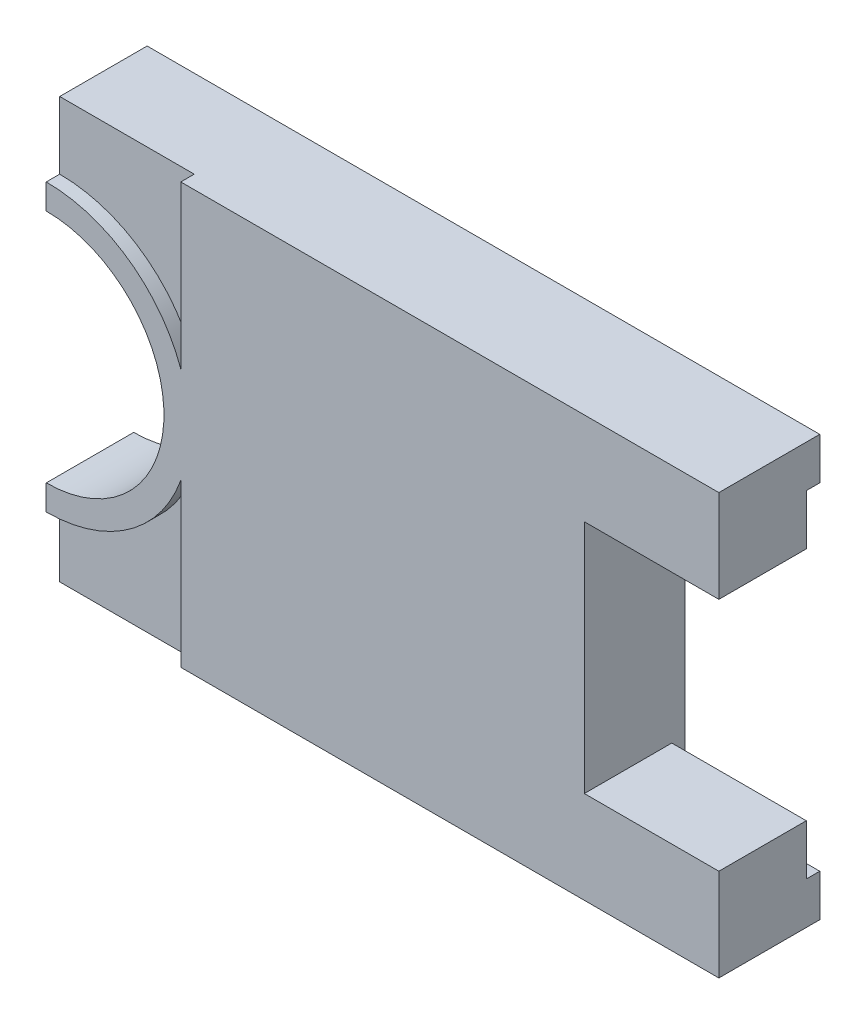
ISO-10303-21;
HEADER;
FILE_DESCRIPTION(('STEP AP214'),'2;1');
FILE_NAME('part.step','',(''),(''),'','','');
FILE_SCHEMA(('AUTOMOTIVE_DESIGN { 1 0 10303 214 1 1 1 1 }'));
ENDSEC;
DATA;
#1=APPLICATION_CONTEXT('core data for automotive mechanical design processes');
#2=APPLICATION_PROTOCOL_DEFINITION('international standard','automotive_design',2000,#1);
#3=PRODUCT_CONTEXT('',#1,'mechanical');
#4=PRODUCT('Part','Part','',(#3));
#5=PRODUCT_RELATED_PRODUCT_CATEGORY('part','',(#4));
#6=PRODUCT_DEFINITION_FORMATION('','',#4);
#7=PRODUCT_DEFINITION_CONTEXT('part definition',#1,'design');
#8=PRODUCT_DEFINITION('design','',#6,#7);
#9=PRODUCT_DEFINITION_SHAPE('','',#8);
#10=(LENGTH_UNIT() NAMED_UNIT(*) SI_UNIT(.MILLI.,.METRE.));
#11=(NAMED_UNIT(*) PLANE_ANGLE_UNIT() SI_UNIT($,.RADIAN.));
#12=(NAMED_UNIT(*) SI_UNIT($,.STERADIAN.) SOLID_ANGLE_UNIT());
#13=UNCERTAINTY_MEASURE_WITH_UNIT(LENGTH_MEASURE(1.E-05),#10,'distance_accuracy_value','');
#14=(GEOMETRIC_REPRESENTATION_CONTEXT(3) GLOBAL_UNCERTAINTY_ASSIGNED_CONTEXT((#13)) GLOBAL_UNIT_ASSIGNED_CONTEXT((#10,
#11,#12)) REPRESENTATION_CONTEXT('',''));
#15=CARTESIAN_POINT('',(0.,0.,0.));
#16=DIRECTION('',(0.,0.,1.));
#17=DIRECTION('',(1.,0.,0.));
#18=AXIS2_PLACEMENT_3D('',#15,#16,#17);
#19=CARTESIAN_POINT('',(-0.2,0.,0.04));
#20=DIRECTION('',(0.,0.,1.));
#21=DIRECTION('',(1.,0.,0.));
#22=AXIS2_PLACEMENT_3D('',#19,#20,#21);
#23=PLANE('',#22);
#24=DIRECTION('',(0.,-1.,0.));
#25=VECTOR('',#24,1.);
#26=CARTESIAN_POINT('',(0.2,-0.230940107676,0.04));
#27=LINE('',#26,#25);
#28=CARTESIAN_POINT('',(0.200000000000004,-0.230940107675994,0.04));
#29=VERTEX_POINT('',#28);
#30=CARTESIAN_POINT('',(0.2,0.230940107676,0.04));
#31=VERTEX_POINT('',#30);
#32=EDGE_CURVE('E161',#29,#31,#27,.F.);
#33=ORIENTED_EDGE('',*,*,#32,.F.);
#34=DIRECTION('',(-0.866025403784329,0.50000000000019,0.));
#35=VECTOR('',#34,1.);
#36=CARTESIAN_POINT('',(-0.2,0.,0.04));
#37=LINE('',#36,#35);
#38=CARTESIAN_POINT('',(-0.200000000000004,0.,0.04));
#39=VERTEX_POINT('',#38);
#40=EDGE_CURVE('E463',#39,#29,#37,.F.);
#41=ORIENTED_EDGE('',*,*,#40,.F.);
#42=DIRECTION('',(0.866025403784329,0.50000000000019,0.));
#43=VECTOR('',#42,1.);
#44=CARTESIAN_POINT('',(0.2,0.230940107676,0.04));
#45=LINE('',#44,#43);
#46=EDGE_CURVE('E454',#31,#39,#45,.F.);
#47=ORIENTED_EDGE('',*,*,#46,.F.);
#48=EDGE_LOOP('',(#33,#41,#47));
#49=FACE_BOUND('',#48,.T.);
#50=ADVANCED_FACE('F17',(#49),#23,.F.);
#51=CARTESIAN_POINT('',(-1.,-0.625,0.3));
#52=DIRECTION('',(0.,1.,0.));
#53=DIRECTION('',(-1.,0.,0.));
#54=AXIS2_PLACEMENT_3D('',#51,#52,#53);
#55=PLANE('',#54);
#56=DIRECTION('',(-1.,0.,0.));
#57=VECTOR('',#56,1.);
#58=CARTESIAN_POINT('',(-1.,-0.625,0.26));
#59=LINE('',#58,#57);
#60=CARTESIAN_POINT('',(-1.,-0.625,0.26));
#61=VERTEX_POINT('',#60);
#62=CARTESIAN_POINT('',(-0.6,-0.625,0.26));
#63=VERTEX_POINT('',#62);
#64=EDGE_CURVE('E162',#61,#63,#59,.F.);
#65=ORIENTED_EDGE('',*,*,#64,.F.);
#66=DIRECTION('',(0.,0.,1.));
#67=VECTOR('',#66,1.);
#68=CARTESIAN_POINT('',(-1.,-0.625,0.3));
#69=LINE('',#68,#67);
#70=CARTESIAN_POINT('',(-1.,-0.625,0.));
#71=VERTEX_POINT('',#70);
#72=EDGE_CURVE('E178',#71,#61,#69,.T.);
#73=ORIENTED_EDGE('',*,*,#72,.F.);
#74=DIRECTION('',(1.,0.,0.));
#75=VECTOR('',#74,1.);
#76=CARTESIAN_POINT('',(-1.,-0.625,0.));
#77=LINE('',#76,#75);
#78=CARTESIAN_POINT('',(1.,-0.625,0.));
#79=VERTEX_POINT('',#78);
#80=EDGE_CURVE('E414',#71,#79,#77,.T.);
#81=ORIENTED_EDGE('',*,*,#80,.T.);
#82=DIRECTION('',(0.,0.,1.));
#83=VECTOR('',#82,1.);
#84=CARTESIAN_POINT('',(1.,-0.625,0.3));
#85=LINE('',#84,#83);
#86=CARTESIAN_POINT('',(1.,-0.625,0.3));
#87=VERTEX_POINT('',#86);
#88=EDGE_CURVE('E176',#87,#79,#85,.F.);
#89=ORIENTED_EDGE('',*,*,#88,.F.);
#90=DIRECTION('',(-1.,0.,0.));
#91=VECTOR('',#90,1.);
#92=CARTESIAN_POINT('',(-1.,-0.625,0.3));
#93=LINE('',#92,#91);
#94=CARTESIAN_POINT('',(-0.6,-0.625,0.3));
#95=VERTEX_POINT('',#94);
#96=EDGE_CURVE('E168',#95,#87,#93,.F.);
#97=ORIENTED_EDGE('',*,*,#96,.F.);
#98=DIRECTION('',(0.,0.,1.));
#99=VECTOR('',#98,1.);
#100=CARTESIAN_POINT('',(-0.6,-0.625,0.3));
#101=LINE('',#100,#99);
#102=EDGE_CURVE('E151',#63,#95,#101,.T.);
#103=ORIENTED_EDGE('',*,*,#102,.F.);
#104=EDGE_LOOP('',(#65,#73,#81,#89,#97,#103));
#105=FACE_BOUND('',#104,.T.);
#106=ADVANCED_FACE('F174',(#105),#55,.F.);
#107=CARTESIAN_POINT('',(0.2,-0.230940107676,0.04));
#108=DIRECTION('',(-1.,0.,0.));
#109=DIRECTION('',(0.,-1.,0.));
#110=AXIS2_PLACEMENT_3D('',#107,#108,#109);
#111=PLANE('',#110);
#112=ORIENTED_EDGE('',*,*,#32,.T.);
#113=DIRECTION('',(0.,0.,1.));
#114=VECTOR('',#113,1.);
#115=CARTESIAN_POINT('',(0.2,0.230940107676,0.04));
#116=LINE('',#115,#114);
#117=CARTESIAN_POINT('',(0.2,0.230940107676,0.));
#118=VERTEX_POINT('',#117);
#119=EDGE_CURVE('E457',#118,#31,#116,.T.);
#120=ORIENTED_EDGE('',*,*,#119,.F.);
#121=DIRECTION('',(0.,1.,0.));
#122=VECTOR('',#121,1.);
#123=CARTESIAN_POINT('',(0.2,-0.625,0.));
#124=LINE('',#123,#122);
#125=CARTESIAN_POINT('',(0.200000000000004,-0.230940107675994,0.));
#126=VERTEX_POINT('',#125);
#127=EDGE_CURVE('E353',#118,#126,#124,.F.);
#128=ORIENTED_EDGE('',*,*,#127,.T.);
#129=DIRECTION('',(0.,0.,1.));
#130=VECTOR('',#129,1.);
#131=CARTESIAN_POINT('',(0.200000000000014,-0.230940107675975,0.04));
#132=LINE('',#131,#130);
#133=EDGE_CURVE('E460',#29,#126,#132,.F.);
#134=ORIENTED_EDGE('',*,*,#133,.F.);
#135=EDGE_LOOP('',(#112,#120,#128,#134));
#136=FACE_BOUND('',#135,.T.);
#137=ADVANCED_FACE('F513',(#136),#111,.T.);
#138=CARTESIAN_POINT('',(-0.2,0.,0.04));
#139=DIRECTION('',(0.50000000000019,0.866025403784329,0.));
#140=DIRECTION('',(-0.866025403784329,0.50000000000019,0.));
#141=AXIS2_PLACEMENT_3D('',#138,#139,#140);
#142=PLANE('',#141);
#143=ORIENTED_EDGE('',*,*,#40,.T.);
#144=ORIENTED_EDGE('',*,*,#133,.T.);
#145=DIRECTION('',(-0.866025403784298,0.500000000000243,0.));
#146=VECTOR('',#145,1.);
#147=CARTESIAN_POINT('',(0.2,-0.230940107676,0.));
#148=LINE('',#147,#146);
#149=CARTESIAN_POINT('',(-0.200000000000004,0.,0.));
#150=VERTEX_POINT('',#149);
#151=EDGE_CURVE('E350',#126,#150,#148,.T.);
#152=ORIENTED_EDGE('',*,*,#151,.T.);
#153=DIRECTION('',(0.,0.,1.));
#154=VECTOR('',#153,1.);
#155=CARTESIAN_POINT('',(-0.200000000000014,0.,0.04));
#156=LINE('',#155,#154);
#157=EDGE_CURVE('E402',#39,#150,#156,.F.);
#158=ORIENTED_EDGE('',*,*,#157,.F.);
#159=EDGE_LOOP('',(#143,#144,#152,#158));
#160=FACE_BOUND('',#159,.T.);
#161=ADVANCED_FACE('F518',(#160),#142,.T.);
#162=CARTESIAN_POINT('',(0.2,0.230940107676,0.04));
#163=DIRECTION('',(0.50000000000019,-0.866025403784329,0.));
#164=DIRECTION('',(0.866025403784329,0.50000000000019,0.));
#165=AXIS2_PLACEMENT_3D('',#162,#163,#164);
#166=PLANE('',#165);
#167=ORIENTED_EDGE('',*,*,#46,.T.);
#168=ORIENTED_EDGE('',*,*,#157,.T.);
#169=DIRECTION('',(0.866025403784298,0.500000000000243,0.));
#170=VECTOR('',#169,1.);
#171=CARTESIAN_POINT('',(-0.2,0.,0.));
#172=LINE('',#171,#170);
#173=EDGE_CURVE('E346',#150,#118,#172,.T.);
#174=ORIENTED_EDGE('',*,*,#173,.T.);
#175=ORIENTED_EDGE('',*,*,#119,.T.);
#176=EDGE_LOOP('',(#167,#168,#174,#175));
#177=FACE_BOUND('',#176,.T.);
#178=ADVANCED_FACE('F521',(#177),#166,.T.);
#179=CARTESIAN_POINT('',(-0.6,-0.35,2.377498685594));
#180=DIRECTION('',(-1.,0.,0.));
#181=DIRECTION('',(0.,0.,1.));
#182=AXIS2_PLACEMENT_3D('',#179,#180,#181);
#183=PLANE('',#182);
#184=DIRECTION('',(0.,1.,0.));
#185=VECTOR('',#184,1.);
#186=CARTESIAN_POINT('',(-0.6,-0.625,0.));
#187=LINE('',#186,#185);
#188=CARTESIAN_POINT('',(-0.6,0.5,0.));
#189=VERTEX_POINT('',#188);
#190=CARTESIAN_POINT('',(-0.6,-0.5,0.));
#191=VERTEX_POINT('',#190);
#192=EDGE_CURVE('E359',#189,#191,#187,.F.);
#193=ORIENTED_EDGE('',*,*,#192,.T.);
#194=DIRECTION('',(0.,0.,1.));
#195=VECTOR('',#194,1.);
#196=CARTESIAN_POINT('',(-0.6,-0.5,0.04));
#197=LINE('',#196,#195);
#198=CARTESIAN_POINT('',(-0.6,-0.5,0.04));
#199=VERTEX_POINT('',#198);
#200=EDGE_CURVE('E297',#199,#191,#197,.F.);
#201=ORIENTED_EDGE('',*,*,#200,.F.);
#202=DIRECTION('',(0.,1.,0.));
#203=VECTOR('',#202,1.);
#204=CARTESIAN_POINT('',(-0.6,-0.5,0.04));
#205=LINE('',#204,#203);
#206=CARTESIAN_POINT('',(-0.6,0.5,0.04));
#207=VERTEX_POINT('',#206);
#208=EDGE_CURVE('E296',#199,#207,#205,.T.);
#209=ORIENTED_EDGE('',*,*,#208,.T.);
#210=DIRECTION('',(0.,0.,-1.));
#211=VECTOR('',#210,1.);
#212=CARTESIAN_POINT('',(-0.6,0.5,0.04));
#213=LINE('',#212,#211);
#214=EDGE_CURVE('E305',#189,#207,#213,.F.);
#215=ORIENTED_EDGE('',*,*,#214,.F.);
#216=EDGE_LOOP('',(#193,#201,#209,#215));
#217=FACE_BOUND('',#216,.T.);
#218=ADVANCED_FACE('F847',(#217),#183,.T.);
#219=CARTESIAN_POINT('',(1.,-0.5,0.04));
#220=DIRECTION('',(0.,-1.,0.));
#221=DIRECTION('',(0.,0.,-1.));
#222=AXIS2_PLACEMENT_3D('',#219,#220,#221);
#223=PLANE('',#222);
#224=DIRECTION('',(0.,0.,1.));
#225=VECTOR('',#224,1.);
#226=CARTESIAN_POINT('',(0.6,-0.5,2.377498685594));
#227=LINE('',#226,#225);
#228=CARTESIAN_POINT('',(0.6,-0.5,0.));
#229=VERTEX_POINT('',#228);
#230=CARTESIAN_POINT('',(0.6,-0.5,0.0400000000000001));
#231=VERTEX_POINT('',#230);
#232=EDGE_CURVE('E393',#229,#231,#227,.T.);
#233=ORIENTED_EDGE('',*,*,#232,.T.);
#234=DIRECTION('',(-1.,0.,0.));
#235=VECTOR('',#234,1.);
#236=CARTESIAN_POINT('',(1.,-0.5,0.04));
#237=LINE('',#236,#235);
#238=CARTESIAN_POINT('',(1.,-0.5,0.04));
#239=VERTEX_POINT('',#238);
#240=EDGE_CURVE('E385',#239,#231,#237,.T.);
#241=ORIENTED_EDGE('',*,*,#240,.F.);
#242=DIRECTION('',(0.,0.,1.));
#243=VECTOR('',#242,1.);
#244=CARTESIAN_POINT('',(1.,-0.5,0.3));
#245=LINE('',#244,#243);
#246=CARTESIAN_POINT('',(1.,-0.5,0.));
#247=VERTEX_POINT('',#246);
#248=EDGE_CURVE('E420',#239,#247,#245,.F.);
#249=ORIENTED_EDGE('',*,*,#248,.T.);
#250=DIRECTION('',(1.,0.,0.));
#251=VECTOR('',#250,1.);
#252=CARTESIAN_POINT('',(-1.,-0.5,0.));
#253=LINE('',#252,#251);
#254=EDGE_CURVE('E356',#247,#229,#253,.F.);
#255=ORIENTED_EDGE('',*,*,#254,.T.);
#256=EDGE_LOOP('',(#233,#241,#249,#255));
#257=FACE_BOUND('',#256,.T.);
#258=ADVANCED_FACE('F838',(#257),#223,.F.);
#259=CARTESIAN_POINT('',(1.,-0.5,0.04));
#260=DIRECTION('',(0.,0.,-1.));
#261=DIRECTION('',(-1.,0.,0.));
#262=AXIS2_PLACEMENT_3D('',#259,#260,#261);
#263=PLANE('',#262);
#264=ORIENTED_EDGE('',*,*,#240,.T.);
#265=DIRECTION('',(0.,1.,0.));
#266=VECTOR('',#265,1.);
#267=CARTESIAN_POINT('',(0.6,-0.35,0.0400000000000001));
#268=LINE('',#267,#266);
#269=CARTESIAN_POINT('',(0.6,-0.35,0.0400000000000001));
#270=VERTEX_POINT('',#269);
#271=EDGE_CURVE('E265',#231,#270,#268,.T.);
#272=ORIENTED_EDGE('',*,*,#271,.T.);
#273=DIRECTION('',(1.,0.,0.));
#274=VECTOR('',#273,1.);
#275=CARTESIAN_POINT('',(1.,-0.35,0.0400000000000001));
#276=LINE('',#275,#274);
#277=CARTESIAN_POINT('',(1.,-0.35,0.0400000000000001));
#278=VERTEX_POINT('',#277);
#279=EDGE_CURVE('E275',#270,#278,#276,.T.);
#280=ORIENTED_EDGE('',*,*,#279,.T.);
#281=DIRECTION('',(0.,1.,0.));
#282=VECTOR('',#281,1.);
#283=CARTESIAN_POINT('',(1.,-0.625,0.04));
#284=LINE('',#283,#282);
#285=EDGE_CURVE('E417',#278,#239,#284,.F.);
#286=ORIENTED_EDGE('',*,*,#285,.T.);
#287=EDGE_LOOP('',(#264,#272,#280,#286));
#288=FACE_BOUND('',#287,.T.);
#289=ADVANCED_FACE('F541',(#288),#263,.T.);
#290=CARTESIAN_POINT('',(0.6,0.5,0.04));
#291=DIRECTION('',(0.,1.,0.));
#292=DIRECTION('',(0.,0.,1.));
#293=AXIS2_PLACEMENT_3D('',#290,#291,#292);
#294=PLANE('',#293);
#295=DIRECTION('',(0.,0.,1.));
#296=VECTOR('',#295,1.);
#297=CARTESIAN_POINT('',(1.,0.5,0.3));
#298=LINE('',#297,#296);
#299=CARTESIAN_POINT('',(1.,0.5,0.));
#300=VERTEX_POINT('',#299);
#301=CARTESIAN_POINT('',(1.,0.5,0.04));
#302=VERTEX_POINT('',#301);
#303=EDGE_CURVE('E343',#300,#302,#298,.T.);
#304=ORIENTED_EDGE('',*,*,#303,.T.);
#305=DIRECTION('',(-1.,0.,0.));
#306=VECTOR('',#305,1.);
#307=CARTESIAN_POINT('',(1.,0.5,0.04));
#308=LINE('',#307,#306);
#309=CARTESIAN_POINT('',(0.6,0.5,0.0400000000000001));
#310=VERTEX_POINT('',#309);
#311=EDGE_CURVE('E364',#310,#302,#308,.F.);
#312=ORIENTED_EDGE('',*,*,#311,.F.);
#313=DIRECTION('',(0.,0.,1.));
#314=VECTOR('',#313,1.);
#315=CARTESIAN_POINT('',(0.6,0.5,2.377498685594));
#316=LINE('',#315,#314);
#317=CARTESIAN_POINT('',(0.6,0.5,0.));
#318=VERTEX_POINT('',#317);
#319=EDGE_CURVE('E380',#310,#318,#316,.F.);
#320=ORIENTED_EDGE('',*,*,#319,.T.);
#321=DIRECTION('',(1.,0.,0.));
#322=VECTOR('',#321,1.);
#323=CARTESIAN_POINT('',(-1.,0.5,0.));
#324=LINE('',#323,#322);
#325=EDGE_CURVE('E360',#318,#300,#324,.T.);
#326=ORIENTED_EDGE('',*,*,#325,.T.);
#327=EDGE_LOOP('',(#304,#312,#320,#326));
#328=FACE_BOUND('',#327,.T.);
#329=ADVANCED_FACE('F819',(#328),#294,.F.);
#330=CARTESIAN_POINT('',(1.,-0.5,0.04));
#331=DIRECTION('',(0.,0.,-1.));
#332=DIRECTION('',(-1.,0.,0.));
#333=AXIS2_PLACEMENT_3D('',#330,#331,#332);
#334=PLANE('',#333);
#335=ORIENTED_EDGE('',*,*,#311,.T.);
#336=DIRECTION('',(0.,1.,0.));
#337=VECTOR('',#336,1.);
#338=CARTESIAN_POINT('',(1.,-0.625,0.04));
#339=LINE('',#338,#337);
#340=CARTESIAN_POINT('',(1.,0.35,0.04));
#341=VERTEX_POINT('',#340);
#342=EDGE_CURVE('E325',#302,#341,#339,.F.);
#343=ORIENTED_EDGE('',*,*,#342,.T.);
#344=DIRECTION('',(-1.,0.,0.));
#345=VECTOR('',#344,1.);
#346=CARTESIAN_POINT('',(0.6,0.35,0.0400000000000001));
#347=LINE('',#346,#345);
#348=CARTESIAN_POINT('',(0.6,0.35,0.0400000000000001));
#349=VERTEX_POINT('',#348);
#350=EDGE_CURVE('E242',#341,#349,#347,.T.);
#351=ORIENTED_EDGE('',*,*,#350,.T.);
#352=DIRECTION('',(0.,1.,0.));
#353=VECTOR('',#352,1.);
#354=CARTESIAN_POINT('',(0.6,-0.35,0.0400000000000001));
#355=LINE('',#354,#353);
#356=EDGE_CURVE('E264',#349,#310,#355,.T.);
#357=ORIENTED_EDGE('',*,*,#356,.T.);
#358=EDGE_LOOP('',(#335,#343,#351,#357));
#359=FACE_BOUND('',#358,.T.);
#360=ADVANCED_FACE('F809',(#359),#334,.T.);
#361=CARTESIAN_POINT('',(-1.,-0.625,0.));
#362=DIRECTION('',(0.,0.,1.));
#363=DIRECTION('',(1.,0.,0.));
#364=AXIS2_PLACEMENT_3D('',#361,#362,#363);
#365=PLANE('',#364);
#366=ORIENTED_EDGE('',*,*,#151,.F.);
#367=ORIENTED_EDGE('',*,*,#127,.F.);
#368=ORIENTED_EDGE('',*,*,#173,.F.);
#369=EDGE_LOOP('',(#366,#367,#368));
#370=FACE_BOUND('',#369,.T.);
#371=ORIENTED_EDGE('',*,*,#254,.F.);
#372=DIRECTION('',(0.,1.,0.));
#373=VECTOR('',#372,1.);
#374=CARTESIAN_POINT('',(1.,-0.625,0.));
#375=LINE('',#374,#373);
#376=EDGE_CURVE('E276',#247,#79,#375,.F.);
#377=ORIENTED_EDGE('',*,*,#376,.T.);
#378=ORIENTED_EDGE('',*,*,#80,.F.);
#379=DIRECTION('',(0.,1.,0.));
#380=VECTOR('',#379,1.);
#381=CARTESIAN_POINT('',(-1.,-0.625,0.));
#382=LINE('',#381,#380);
#383=CARTESIAN_POINT('',(-1.,-0.5,0.));
#384=VERTEX_POINT('',#383);
#385=EDGE_CURVE('E84',#384,#71,#382,.F.);
#386=ORIENTED_EDGE('',*,*,#385,.F.);
#387=DIRECTION('',(-1.,0.,0.));
#388=VECTOR('',#387,1.);
#389=CARTESIAN_POINT('',(-1.,-0.5,0.));
#390=LINE('',#389,#388);
#391=EDGE_CURVE('E303',#191,#384,#390,.T.);
#392=ORIENTED_EDGE('',*,*,#391,.F.);
#393=ORIENTED_EDGE('',*,*,#192,.F.);
#394=DIRECTION('',(1.,0.,0.));
#395=VECTOR('',#394,1.);
#396=CARTESIAN_POINT('',(-0.6,0.5,0.));
#397=LINE('',#396,#395);
#398=CARTESIAN_POINT('',(-1.,0.5,0.));
#399=VERTEX_POINT('',#398);
#400=EDGE_CURVE('E349',#399,#189,#397,.T.);
#401=ORIENTED_EDGE('',*,*,#400,.F.);
#402=DIRECTION('',(0.,1.,0.));
#403=VECTOR('',#402,1.);
#404=CARTESIAN_POINT('',(-1.,-0.625,0.));
#405=LINE('',#404,#403);
#406=CARTESIAN_POINT('',(-1.,0.625,0.));
#407=VERTEX_POINT('',#406);
#408=EDGE_CURVE('E357',#407,#399,#405,.F.);
#409=ORIENTED_EDGE('',*,*,#408,.F.);
#410=DIRECTION('',(1.,0.,0.));
#411=VECTOR('',#410,1.);
#412=CARTESIAN_POINT('',(1.,0.625,0.));
#413=LINE('',#412,#411);
#414=CARTESIAN_POINT('',(1.,0.625,0.));
#415=VERTEX_POINT('',#414);
#416=EDGE_CURVE('E230',#407,#415,#413,.T.);
#417=ORIENTED_EDGE('',*,*,#416,.T.);
#418=DIRECTION('',(0.,1.,0.));
#419=VECTOR('',#418,1.);
#420=CARTESIAN_POINT('',(1.,-0.625,0.));
#421=LINE('',#420,#419);
#422=EDGE_CURVE('E241',#415,#300,#421,.F.);
#423=ORIENTED_EDGE('',*,*,#422,.T.);
#424=ORIENTED_EDGE('',*,*,#325,.F.);
#425=DIRECTION('',(0.,1.,0.));
#426=VECTOR('',#425,1.);
#427=CARTESIAN_POINT('',(0.6,-0.35,0.));
#428=LINE('',#427,#426);
#429=EDGE_CURVE('E253',#318,#229,#428,.F.);
#430=ORIENTED_EDGE('',*,*,#429,.T.);
#431=EDGE_LOOP('',(#371,#377,#378,#386,#392,#393,#401,#409,#417,#423,#424,#430));
#432=FACE_BOUND('',#431,.T.);
#433=ADVANCED_FACE('F485',(#370,#432),#365,.F.);
#434=CARTESIAN_POINT('',(-0.6,0.5,0.04));
#435=DIRECTION('',(0.,-1.,0.));
#436=DIRECTION('',(0.,0.,-1.));
#437=AXIS2_PLACEMENT_3D('',#434,#435,#436);
#438=PLANE('',#437);
#439=DIRECTION('',(1.,0.,0.));
#440=VECTOR('',#439,1.);
#441=CARTESIAN_POINT('',(-1.,0.5,0.04));
#442=LINE('',#441,#440);
#443=CARTESIAN_POINT('',(-1.,0.5,0.04));
#444=VERTEX_POINT('',#443);
#445=EDGE_CURVE('E328',#207,#444,#442,.F.);
#446=ORIENTED_EDGE('',*,*,#445,.T.);
#447=DIRECTION('',(0.,0.,-1.));
#448=VECTOR('',#447,1.);
#449=CARTESIAN_POINT('',(-1.,0.5,0.3));
#450=LINE('',#449,#448);
#451=EDGE_CURVE('E207',#444,#399,#450,.T.);
#452=ORIENTED_EDGE('',*,*,#451,.T.);
#453=ORIENTED_EDGE('',*,*,#400,.T.);
#454=ORIENTED_EDGE('',*,*,#214,.T.);
#455=EDGE_LOOP('',(#446,#452,#453,#454));
#456=FACE_BOUND('',#455,.T.);
#457=ADVANCED_FACE('F601',(#456),#438,.T.);
#458=CARTESIAN_POINT('',(-1.,0.,0.26));
#459=DIRECTION('',(0.,0.,-1.));
#460=DIRECTION('',(-1.,0.,0.));
#461=AXIS2_PLACEMENT_3D('',#458,#459,#460);
#462=PLANE('',#461);
#463=DIRECTION('',(1.,0.,0.));
#464=VECTOR('',#463,1.);
#465=CARTESIAN_POINT('',(1.,0.625,0.26));
#466=LINE('',#465,#464);
#467=CARTESIAN_POINT('',(-0.6,0.625,0.26));
#468=VERTEX_POINT('',#467);
#469=CARTESIAN_POINT('',(-1.,0.625,0.26));
#470=VERTEX_POINT('',#469);
#471=EDGE_CURVE('E229',#468,#470,#466,.F.);
#472=ORIENTED_EDGE('',*,*,#471,.T.);
#473=DIRECTION('',(0.,1.,0.));
#474=VECTOR('',#473,1.);
#475=CARTESIAN_POINT('',(-1.,0.625,0.26));
#476=LINE('',#475,#474);
#477=CARTESIAN_POINT('',(-1.,0.425,0.26));
#478=VERTEX_POINT('',#477);
#479=EDGE_CURVE('E310',#470,#478,#476,.F.);
#480=ORIENTED_EDGE('',*,*,#479,.T.);
#481=CARTESIAN_POINT('',(-1.,0.,0.26));
#482=DIRECTION('',(0.,0.,-1.));
#483=DIRECTION('',(-1.,0.,0.));
#484=AXIS2_PLACEMENT_3D('',#481,#482,#483);
#485=CIRCLE('',#484,0.425);
#486=CARTESIAN_POINT('',(-0.599999999999928,0.143614066163251,0.26));
#487=VERTEX_POINT('',#486);
#488=EDGE_CURVE('E198',#487,#478,#485,.F.);
#489=ORIENTED_EDGE('',*,*,#488,.F.);
#490=DIRECTION('',(0.,1.,0.));
#491=VECTOR('',#490,1.);
#492=CARTESIAN_POINT('',(-0.6,0.143614066163,0.26));
#493=LINE('',#492,#491);
#494=EDGE_CURVE('E213',#487,#468,#493,.T.);
#495=ORIENTED_EDGE('',*,*,#494,.T.);
#496=EDGE_LOOP('',(#472,#480,#489,#495));
#497=FACE_BOUND('',#496,.T.);
#498=ADVANCED_FACE('F576',(#497),#462,.F.);
#499=CARTESIAN_POINT('',(-1.,0.,0.26));
#500=DIRECTION('',(0.,0.,1.));
#501=DIRECTION('',(1.,0.,0.));
#502=AXIS2_PLACEMENT_3D('',#499,#500,#501);
#503=PLANE('',#502);
#504=DIRECTION('',(0.,1.,0.));
#505=VECTOR('',#504,1.);
#506=CARTESIAN_POINT('',(-1.,0.625,0.26));
#507=LINE('',#506,#505);
#508=CARTESIAN_POINT('',(-1.,-0.425,0.26));
#509=VERTEX_POINT('',#508);
#510=EDGE_CURVE('E284',#509,#61,#507,.F.);
#511=ORIENTED_EDGE('',*,*,#510,.T.);
#512=ORIENTED_EDGE('',*,*,#64,.T.);
#513=DIRECTION('',(0.,-1.,0.));
#514=VECTOR('',#513,1.);
#515=CARTESIAN_POINT('',(-0.6,-0.143614066163,0.26));
#516=LINE('',#515,#514);
#517=CARTESIAN_POINT('',(-0.6,-0.143614066163225,0.26));
#518=VERTEX_POINT('',#517);
#519=EDGE_CURVE('E157',#518,#63,#516,.T.);
#520=ORIENTED_EDGE('',*,*,#519,.F.);
#521=CARTESIAN_POINT('',(-1.,0.,0.26));
#522=DIRECTION('',(0.,0.,-1.));
#523=DIRECTION('',(-1.,0.,0.));
#524=AXIS2_PLACEMENT_3D('',#521,#522,#523);
#525=CIRCLE('',#524,0.425);
#526=EDGE_CURVE('E20',#509,#518,#525,.F.);
#527=ORIENTED_EDGE('',*,*,#526,.F.);
#528=EDGE_LOOP('',(#511,#512,#520,#527));
#529=FACE_BOUND('',#528,.T.);
#530=ADVANCED_FACE('F480',(#529),#503,.T.);
#531=CARTESIAN_POINT('',(-1.,-0.5,0.04));
#532=DIRECTION('',(0.,1.,0.));
#533=DIRECTION('',(-1.,0.,0.));
#534=AXIS2_PLACEMENT_3D('',#531,#532,#533);
#535=PLANE('',#534);
#536=DIRECTION('',(1.,0.,0.));
#537=VECTOR('',#536,1.);
#538=CARTESIAN_POINT('',(-1.,-0.5,0.04));
#539=LINE('',#538,#537);
#540=CARTESIAN_POINT('',(-1.,-0.5,0.04));
#541=VERTEX_POINT('',#540);
#542=EDGE_CURVE('E293',#541,#199,#539,.T.);
#543=ORIENTED_EDGE('',*,*,#542,.T.);
#544=ORIENTED_EDGE('',*,*,#200,.T.);
#545=ORIENTED_EDGE('',*,*,#391,.T.);
#546=DIRECTION('',(0.,0.,-1.));
#547=VECTOR('',#546,1.);
#548=CARTESIAN_POINT('',(-1.,-0.5,0.3));
#549=LINE('',#548,#547);
#550=EDGE_CURVE('E286',#384,#541,#549,.F.);
#551=ORIENTED_EDGE('',*,*,#550,.T.);
#552=EDGE_LOOP('',(#543,#544,#545,#551));
#553=FACE_BOUND('',#552,.T.);
#554=ADVANCED_FACE('F621',(#553),#535,.T.);
#555=CARTESIAN_POINT('',(-1.,-0.5,0.04));
#556=DIRECTION('',(0.,0.,1.));
#557=DIRECTION('',(1.,0.,0.));
#558=AXIS2_PLACEMENT_3D('',#555,#556,#557);
#559=PLANE('',#558);
#560=CARTESIAN_POINT('',(-1.,0.,0.04));
#561=DIRECTION('',(0.,0.,-1.));
#562=DIRECTION('',(-1.,0.,0.));
#563=AXIS2_PLACEMENT_3D('',#560,#561,#562);
#564=CIRCLE('',#563,0.35);
#565=CARTESIAN_POINT('',(-1.,-0.35,0.04));
#566=VERTEX_POINT('',#565);
#567=CARTESIAN_POINT('',(-1.,0.35,0.04));
#568=VERTEX_POINT('',#567);
#569=EDGE_CURVE('E195',#566,#568,#564,.F.);
#570=ORIENTED_EDGE('',*,*,#569,.T.);
#571=DIRECTION('',(0.,1.,0.));
#572=VECTOR('',#571,1.);
#573=CARTESIAN_POINT('',(-1.,0.625,0.04));
#574=LINE('',#573,#572);
#575=EDGE_CURVE('E200',#568,#444,#574,.T.);
#576=ORIENTED_EDGE('',*,*,#575,.T.);
#577=ORIENTED_EDGE('',*,*,#445,.F.);
#578=ORIENTED_EDGE('',*,*,#208,.F.);
#579=ORIENTED_EDGE('',*,*,#542,.F.);
#580=DIRECTION('',(0.,1.,0.));
#581=VECTOR('',#580,1.);
#582=CARTESIAN_POINT('',(-1.,0.625,0.04));
#583=LINE('',#582,#581);
#584=EDGE_CURVE('E289',#541,#566,#583,.T.);
#585=ORIENTED_EDGE('',*,*,#584,.T.);
#586=EDGE_LOOP('',(#570,#576,#577,#578,#579,#585));
#587=FACE_BOUND('',#586,.T.);
#588=ADVANCED_FACE('F605',(#587),#559,.F.);
#589=CARTESIAN_POINT('',(-1.,0.,0.26));
#590=DIRECTION('',(0.,0.,-1.));
#591=DIRECTION('',(-1.,0.,0.));
#592=AXIS2_PLACEMENT_3D('',#589,#590,#591);
#593=CYLINDRICAL_SURFACE('',#592,0.425);
#594=ORIENTED_EDGE('',*,*,#526,.T.);
#595=DIRECTION('',(0.,0.,1.));
#596=VECTOR('',#595,1.);
#597=CARTESIAN_POINT('',(-0.6,-0.143614066163,0.26));
#598=LINE('',#597,#596);
#599=CARTESIAN_POINT('',(-0.6,-0.143614066163225,0.3));
#600=VERTEX_POINT('',#599);
#601=EDGE_CURVE('E282',#600,#518,#598,.F.);
#602=ORIENTED_EDGE('',*,*,#601,.F.);
#603=CARTESIAN_POINT('',(-1.,0.,0.3));
#604=DIRECTION('',(0.,0.,-1.));
#605=DIRECTION('',(-1.,0.,0.));
#606=AXIS2_PLACEMENT_3D('',#603,#604,#605);
#607=CIRCLE('',#606,0.425);
#608=CARTESIAN_POINT('',(-1.,-0.425,0.3));
#609=VERTEX_POINT('',#608);
#610=EDGE_CURVE('E170',#609,#600,#607,.F.);
#611=ORIENTED_EDGE('',*,*,#610,.F.);
#612=DIRECTION('',(0.,0.,-1.));
#613=VECTOR('',#612,1.);
#614=CARTESIAN_POINT('',(-1.,-0.425,0.3));
#615=LINE('',#614,#613);
#616=EDGE_CURVE('E194',#609,#509,#615,.T.);
#617=ORIENTED_EDGE('',*,*,#616,.T.);
#618=EDGE_LOOP('',(#594,#602,#611,#617));
#619=FACE_BOUND('',#618,.T.);
#620=ADVANCED_FACE('F612',(#619),#593,.T.);
#621=CARTESIAN_POINT('',(-0.6,-0.143614066163,0.26));
#622=DIRECTION('',(-1.,0.,0.));
#623=DIRECTION('',(0.,-1.,0.));
#624=AXIS2_PLACEMENT_3D('',#621,#622,#623);
#625=PLANE('',#624);
#626=ORIENTED_EDGE('',*,*,#519,.T.);
#627=ORIENTED_EDGE('',*,*,#102,.T.);
#628=DIRECTION('',(0.,1.,0.));
#629=VECTOR('',#628,1.);
#630=CARTESIAN_POINT('',(-0.6,-0.625,0.3));
#631=LINE('',#630,#629);
#632=EDGE_CURVE('E155',#600,#95,#631,.F.);
#633=ORIENTED_EDGE('',*,*,#632,.F.);
#634=ORIENTED_EDGE('',*,*,#601,.T.);
#635=EDGE_LOOP('',(#626,#627,#633,#634));
#636=FACE_BOUND('',#635,.T.);
#637=ADVANCED_FACE('F153',(#636),#625,.T.);
#638=CARTESIAN_POINT('',(1.,-0.625,0.3));
#639=DIRECTION('',(-1.,0.,0.));
#640=DIRECTION('',(0.,0.,1.));
#641=AXIS2_PLACEMENT_3D('',#638,#639,#640);
#642=PLANE('',#641);
#643=ORIENTED_EDGE('',*,*,#248,.F.);
#644=ORIENTED_EDGE('',*,*,#285,.F.);
#645=DIRECTION('',(0.,0.,1.));
#646=VECTOR('',#645,1.);
#647=CARTESIAN_POINT('',(1.,-0.35,2.377498685594));
#648=LINE('',#647,#646);
#649=CARTESIAN_POINT('',(1.,-0.35,0.3));
#650=VERTEX_POINT('',#649);
#651=EDGE_CURVE('E272',#278,#650,#648,.T.);
#652=ORIENTED_EDGE('',*,*,#651,.T.);
#653=DIRECTION('',(0.,1.,0.));
#654=VECTOR('',#653,1.);
#655=CARTESIAN_POINT('',(1.,-0.625,0.3));
#656=LINE('',#655,#654);
#657=EDGE_CURVE('E171',#87,#650,#656,.T.);
#658=ORIENTED_EDGE('',*,*,#657,.F.);
#659=ORIENTED_EDGE('',*,*,#88,.T.);
#660=ORIENTED_EDGE('',*,*,#376,.F.);
#661=EDGE_LOOP('',(#643,#644,#652,#658,#659,#660));
#662=FACE_BOUND('',#661,.T.);
#663=ADVANCED_FACE('F489',(#662),#642,.F.);
#664=CARTESIAN_POINT('',(1.,-0.35,2.377498685594));
#665=DIRECTION('',(0.,-1.,0.));
#666=DIRECTION('',(1.,0.,0.));
#667=AXIS2_PLACEMENT_3D('',#664,#665,#666);
#668=PLANE('',#667);
#669=DIRECTION('',(0.,0.,1.));
#670=VECTOR('',#669,1.);
#671=CARTESIAN_POINT('',(0.6,-0.35,2.377498685594));
#672=LINE('',#671,#670);
#673=CARTESIAN_POINT('',(0.6,-0.35,0.3));
#674=VERTEX_POINT('',#673);
#675=EDGE_CURVE('E261',#270,#674,#672,.T.);
#676=ORIENTED_EDGE('',*,*,#675,.T.);
#677=DIRECTION('',(1.,0.,0.));
#678=VECTOR('',#677,1.);
#679=CARTESIAN_POINT('',(-1.,-0.35,0.3));
#680=LINE('',#679,#678);
#681=EDGE_CURVE('E258',#650,#674,#680,.F.);
#682=ORIENTED_EDGE('',*,*,#681,.F.);
#683=ORIENTED_EDGE('',*,*,#651,.F.);
#684=ORIENTED_EDGE('',*,*,#279,.F.);
#685=EDGE_LOOP('',(#676,#682,#683,#684));
#686=FACE_BOUND('',#685,.T.);
#687=ADVANCED_FACE('F547',(#686),#668,.F.);
#688=CARTESIAN_POINT('',(0.6,-0.35,2.377498685594));
#689=DIRECTION('',(-1.,0.,0.));
#690=DIRECTION('',(0.,0.,1.));
#691=AXIS2_PLACEMENT_3D('',#688,#689,#690);
#692=PLANE('',#691);
#693=ORIENTED_EDGE('',*,*,#319,.F.);
#694=ORIENTED_EDGE('',*,*,#356,.F.);
#695=DIRECTION('',(0.,0.,1.));
#696=VECTOR('',#695,1.);
#697=CARTESIAN_POINT('',(0.6,0.35,2.377498685594));
#698=LINE('',#697,#696);
#699=CARTESIAN_POINT('',(0.6,0.35,0.3));
#700=VERTEX_POINT('',#699);
#701=EDGE_CURVE('E250',#349,#700,#698,.T.);
#702=ORIENTED_EDGE('',*,*,#701,.T.);
#703=DIRECTION('',(0.,1.,0.));
#704=VECTOR('',#703,1.);
#705=CARTESIAN_POINT('',(0.6,-0.625,0.3));
#706=LINE('',#705,#704);
#707=EDGE_CURVE('E247',#674,#700,#706,.T.);
#708=ORIENTED_EDGE('',*,*,#707,.F.);
#709=ORIENTED_EDGE('',*,*,#675,.F.);
#710=ORIENTED_EDGE('',*,*,#271,.F.);
#711=ORIENTED_EDGE('',*,*,#232,.F.);
#712=ORIENTED_EDGE('',*,*,#429,.F.);
#713=EDGE_LOOP('',(#693,#694,#702,#708,#709,#710,#711,#712));
#714=FACE_BOUND('',#713,.T.);
#715=ADVANCED_FACE('F551',(#714),#692,.F.);
#716=CARTESIAN_POINT('',(0.6,0.35,2.377498685594));
#717=DIRECTION('',(0.,1.,0.));
#718=DIRECTION('',(-1.,0.,0.));
#719=AXIS2_PLACEMENT_3D('',#716,#717,#718);
#720=PLANE('',#719);
#721=DIRECTION('',(0.,0.,1.));
#722=VECTOR('',#721,1.);
#723=CARTESIAN_POINT('',(1.,0.35,0.3));
#724=LINE('',#723,#722);
#725=CARTESIAN_POINT('',(1.,0.35,0.3));
#726=VERTEX_POINT('',#725);
#727=EDGE_CURVE('E238',#341,#726,#724,.T.);
#728=ORIENTED_EDGE('',*,*,#727,.T.);
#729=DIRECTION('',(1.,0.,0.));
#730=VECTOR('',#729,1.);
#731=CARTESIAN_POINT('',(-1.,0.35,0.3));
#732=LINE('',#731,#730);
#733=EDGE_CURVE('E235',#700,#726,#732,.T.);
#734=ORIENTED_EDGE('',*,*,#733,.F.);
#735=ORIENTED_EDGE('',*,*,#701,.F.);
#736=ORIENTED_EDGE('',*,*,#350,.F.);
#737=EDGE_LOOP('',(#728,#734,#735,#736));
#738=FACE_BOUND('',#737,.T.);
#739=ADVANCED_FACE('F556',(#738),#720,.F.);
#740=CARTESIAN_POINT('',(1.,-0.625,0.3));
#741=DIRECTION('',(-1.,0.,0.));
#742=DIRECTION('',(0.,0.,1.));
#743=AXIS2_PLACEMENT_3D('',#740,#741,#742);
#744=PLANE('',#743);
#745=ORIENTED_EDGE('',*,*,#303,.F.);
#746=ORIENTED_EDGE('',*,*,#422,.F.);
#747=DIRECTION('',(0.,0.,1.));
#748=VECTOR('',#747,1.);
#749=CARTESIAN_POINT('',(1.,0.625,0.3));
#750=LINE('',#749,#748);
#751=CARTESIAN_POINT('',(1.,0.625,0.3));
#752=VERTEX_POINT('',#751);
#753=EDGE_CURVE('E226',#415,#752,#750,.T.);
#754=ORIENTED_EDGE('',*,*,#753,.T.);
#755=DIRECTION('',(0.,1.,0.));
#756=VECTOR('',#755,1.);
#757=CARTESIAN_POINT('',(1.,-0.625,0.3));
#758=LINE('',#757,#756);
#759=EDGE_CURVE('E223',#726,#752,#758,.T.);
#760=ORIENTED_EDGE('',*,*,#759,.F.);
#761=ORIENTED_EDGE('',*,*,#727,.F.);
#762=ORIENTED_EDGE('',*,*,#342,.F.);
#763=EDGE_LOOP('',(#745,#746,#754,#760,#761,#762));
#764=FACE_BOUND('',#763,.T.);
#765=ADVANCED_FACE('F561',(#764),#744,.F.);
#766=CARTESIAN_POINT('',(1.,0.625,0.3));
#767=DIRECTION('',(0.,-1.,0.));
#768=DIRECTION('',(1.,0.,0.));
#769=AXIS2_PLACEMENT_3D('',#766,#767,#768);
#770=PLANE('',#769);
#771=DIRECTION('',(0.,0.,1.));
#772=VECTOR('',#771,1.);
#773=CARTESIAN_POINT('',(-0.6,0.625,0.26));
#774=LINE('',#773,#772);
#775=CARTESIAN_POINT('',(-0.6,0.625,0.3));
#776=VERTEX_POINT('',#775);
#777=EDGE_CURVE('E209',#468,#776,#774,.T.);
#778=ORIENTED_EDGE('',*,*,#777,.T.);
#779=DIRECTION('',(1.,0.,0.));
#780=VECTOR('',#779,1.);
#781=CARTESIAN_POINT('',(-1.,0.625,0.3));
#782=LINE('',#781,#780);
#783=EDGE_CURVE('E220',#752,#776,#782,.F.);
#784=ORIENTED_EDGE('',*,*,#783,.F.);
#785=ORIENTED_EDGE('',*,*,#753,.F.);
#786=ORIENTED_EDGE('',*,*,#416,.F.);
#787=DIRECTION('',(0.,0.,-1.));
#788=VECTOR('',#787,1.);
#789=CARTESIAN_POINT('',(-1.,0.625,0.3));
#790=LINE('',#789,#788);
#791=EDGE_CURVE('E312',#407,#470,#790,.F.);
#792=ORIENTED_EDGE('',*,*,#791,.T.);
#793=ORIENTED_EDGE('',*,*,#471,.F.);
#794=EDGE_LOOP('',(#778,#784,#785,#786,#792,#793));
#795=FACE_BOUND('',#794,.T.);
#796=ADVANCED_FACE('F567',(#795),#770,.F.);
#797=CARTESIAN_POINT('',(-0.6,0.143614066163,0.26));
#798=DIRECTION('',(1.,0.,0.));
#799=DIRECTION('',(0.,1.,0.));
#800=AXIS2_PLACEMENT_3D('',#797,#798,#799);
#801=PLANE('',#800);
#802=ORIENTED_EDGE('',*,*,#777,.F.);
#803=ORIENTED_EDGE('',*,*,#494,.F.);
#804=DIRECTION('',(0.,0.,-1.));
#805=VECTOR('',#804,1.);
#806=CARTESIAN_POINT('',(-0.599999999999857,0.143614066163051,0.26));
#807=LINE('',#806,#805);
#808=CARTESIAN_POINT('',(-0.599999999999928,0.143614066163251,0.3));
#809=VERTEX_POINT('',#808);
#810=EDGE_CURVE('E201',#809,#487,#807,.T.);
#811=ORIENTED_EDGE('',*,*,#810,.F.);
#812=DIRECTION('',(0.,1.,0.));
#813=VECTOR('',#812,1.);
#814=CARTESIAN_POINT('',(-0.6,-0.625,0.3));
#815=LINE('',#814,#813);
#816=EDGE_CURVE('E192',#776,#809,#815,.F.);
#817=ORIENTED_EDGE('',*,*,#816,.F.);
#818=EDGE_LOOP('',(#802,#803,#811,#817));
#819=FACE_BOUND('',#818,.T.);
#820=ADVANCED_FACE('F580',(#819),#801,.F.);
#821=CARTESIAN_POINT('',(-1.,0.,0.26));
#822=DIRECTION('',(0.,0.,-1.));
#823=DIRECTION('',(-1.,0.,0.));
#824=AXIS2_PLACEMENT_3D('',#821,#822,#823);
#825=CYLINDRICAL_SURFACE('',#824,0.425);
#826=ORIENTED_EDGE('',*,*,#488,.T.);
#827=DIRECTION('',(0.,0.,-1.));
#828=VECTOR('',#827,1.);
#829=CARTESIAN_POINT('',(-1.,0.425,0.3));
#830=LINE('',#829,#828);
#831=CARTESIAN_POINT('',(-1.,0.425,0.3));
#832=VERTEX_POINT('',#831);
#833=EDGE_CURVE('E197',#478,#832,#830,.F.);
#834=ORIENTED_EDGE('',*,*,#833,.T.);
#835=CARTESIAN_POINT('',(-1.,0.,0.3));
#836=DIRECTION('',(0.,0.,-1.));
#837=DIRECTION('',(-1.,0.,0.));
#838=AXIS2_PLACEMENT_3D('',#835,#836,#837);
#839=CIRCLE('',#838,0.425);
#840=EDGE_CURVE('E189',#809,#832,#839,.F.);
#841=ORIENTED_EDGE('',*,*,#840,.F.);
#842=ORIENTED_EDGE('',*,*,#810,.T.);
#843=EDGE_LOOP('',(#826,#834,#841,#842));
#844=FACE_BOUND('',#843,.T.);
#845=ADVANCED_FACE('F597',(#844),#825,.T.);
#846=CARTESIAN_POINT('',(-1.,0.625,0.3));
#847=DIRECTION('',(1.,0.,0.));
#848=DIRECTION('',(0.,0.,-1.));
#849=AXIS2_PLACEMENT_3D('',#846,#847,#848);
#850=PLANE('',#849);
#851=ORIENTED_EDGE('',*,*,#833,.F.);
#852=ORIENTED_EDGE('',*,*,#479,.F.);
#853=ORIENTED_EDGE('',*,*,#791,.F.);
#854=ORIENTED_EDGE('',*,*,#408,.T.);
#855=ORIENTED_EDGE('',*,*,#451,.F.);
#856=ORIENTED_EDGE('',*,*,#575,.F.);
#857=DIRECTION('',(0.,0.,-1.));
#858=VECTOR('',#857,1.);
#859=CARTESIAN_POINT('',(-1.,0.35,0.04));
#860=LINE('',#859,#858);
#861=CARTESIAN_POINT('',(-1.,0.35,0.3));
#862=VERTEX_POINT('',#861);
#863=EDGE_CURVE('E196',#568,#862,#860,.F.);
#864=ORIENTED_EDGE('',*,*,#863,.T.);
#865=DIRECTION('',(0.,1.,0.));
#866=VECTOR('',#865,1.);
#867=CARTESIAN_POINT('',(-1.,-0.625,0.3));
#868=LINE('',#867,#866);
#869=EDGE_CURVE('E188',#832,#862,#868,.F.);
#870=ORIENTED_EDGE('',*,*,#869,.F.);
#871=EDGE_LOOP('',(#851,#852,#853,#854,#855,#856,#864,#870));
#872=FACE_BOUND('',#871,.T.);
#873=ADVANCED_FACE('F593',(#872),#850,.F.);
#874=CARTESIAN_POINT('',(-1.,0.,0.04));
#875=DIRECTION('',(0.,0.,-1.));
#876=DIRECTION('',(-1.,0.,0.));
#877=AXIS2_PLACEMENT_3D('',#874,#875,#876);
#878=CYLINDRICAL_SURFACE('',#877,0.35);
#879=ORIENTED_EDGE('',*,*,#863,.F.);
#880=ORIENTED_EDGE('',*,*,#569,.F.);
#881=DIRECTION('',(0.,0.,-1.));
#882=VECTOR('',#881,1.);
#883=CARTESIAN_POINT('',(-1.,-0.35,0.3));
#884=LINE('',#883,#882);
#885=CARTESIAN_POINT('',(-1.,-0.35,0.3));
#886=VERTEX_POINT('',#885);
#887=EDGE_CURVE('E35',#566,#886,#884,.F.);
#888=ORIENTED_EDGE('',*,*,#887,.T.);
#889=CARTESIAN_POINT('',(-1.,0.,0.3));
#890=DIRECTION('',(0.,0.,-1.));
#891=DIRECTION('',(-1.,0.,0.));
#892=AXIS2_PLACEMENT_3D('',#889,#890,#891);
#893=CIRCLE('',#892,0.35);
#894=EDGE_CURVE('E26',#862,#886,#893,.T.);
#895=ORIENTED_EDGE('',*,*,#894,.F.);
#896=EDGE_LOOP('',(#879,#880,#888,#895));
#897=FACE_BOUND('',#896,.T.);
#898=ADVANCED_FACE('F596',(#897),#878,.F.);
#899=CARTESIAN_POINT('',(-1.,0.625,0.3));
#900=DIRECTION('',(1.,0.,0.));
#901=DIRECTION('',(0.,0.,-1.));
#902=AXIS2_PLACEMENT_3D('',#899,#900,#901);
#903=PLANE('',#902);
#904=DIRECTION('',(0.,1.,0.));
#905=VECTOR('',#904,1.);
#906=CARTESIAN_POINT('',(-1.,-0.625,0.3));
#907=LINE('',#906,#905);
#908=EDGE_CURVE('E11',#886,#609,#907,.F.);
#909=ORIENTED_EDGE('',*,*,#908,.F.);
#910=ORIENTED_EDGE('',*,*,#887,.F.);
#911=ORIENTED_EDGE('',*,*,#584,.F.);
#912=ORIENTED_EDGE('',*,*,#550,.F.);
#913=ORIENTED_EDGE('',*,*,#385,.T.);
#914=ORIENTED_EDGE('',*,*,#72,.T.);
#915=ORIENTED_EDGE('',*,*,#510,.F.);
#916=ORIENTED_EDGE('',*,*,#616,.F.);
#917=EDGE_LOOP('',(#909,#910,#911,#912,#913,#914,#915,#916));
#918=FACE_BOUND('',#917,.T.);
#919=ADVANCED_FACE('F608',(#918),#903,.F.);
#920=CARTESIAN_POINT('',(-1.,-0.625,0.3));
#921=DIRECTION('',(0.,0.,1.));
#922=DIRECTION('',(1.,0.,0.));
#923=AXIS2_PLACEMENT_3D('',#920,#921,#922);
#924=PLANE('',#923);
#925=ORIENTED_EDGE('',*,*,#894,.T.);
#926=ORIENTED_EDGE('',*,*,#908,.T.);
#927=ORIENTED_EDGE('',*,*,#610,.T.);
#928=ORIENTED_EDGE('',*,*,#632,.T.);
#929=ORIENTED_EDGE('',*,*,#96,.T.);
#930=ORIENTED_EDGE('',*,*,#657,.T.);
#931=ORIENTED_EDGE('',*,*,#681,.T.);
#932=ORIENTED_EDGE('',*,*,#707,.T.);
#933=ORIENTED_EDGE('',*,*,#733,.T.);
#934=ORIENTED_EDGE('',*,*,#759,.T.);
#935=ORIENTED_EDGE('',*,*,#783,.T.);
#936=ORIENTED_EDGE('',*,*,#816,.T.);
#937=ORIENTED_EDGE('',*,*,#840,.T.);
#938=ORIENTED_EDGE('',*,*,#869,.T.);
#939=EDGE_LOOP('',(#925,#926,#927,#928,#929,#930,#931,#932,#933,#934,#935,#936,#937,#938));
#940=FACE_BOUND('',#939,.T.);
#941=ADVANCED_FACE('F166',(#940),#924,.T.);
#942=CLOSED_SHELL('',(#50,#106,#137,#161,#178,#218,#258,#289,#329,#360,#433,#457,#498,#530,#554,
#588,#620,#637,#663,#687,#715,#739,#765,#796,#820,#845,#873,#898,#919,#941));
#943=MANIFOLD_SOLID_BREP('B1',#942);
#944=ADVANCED_BREP_SHAPE_REPRESENTATION('',(#18,#943),#14);
#945=SHAPE_DEFINITION_REPRESENTATION(#9,#944);
ENDSEC;
END-ISO-10303-21;
